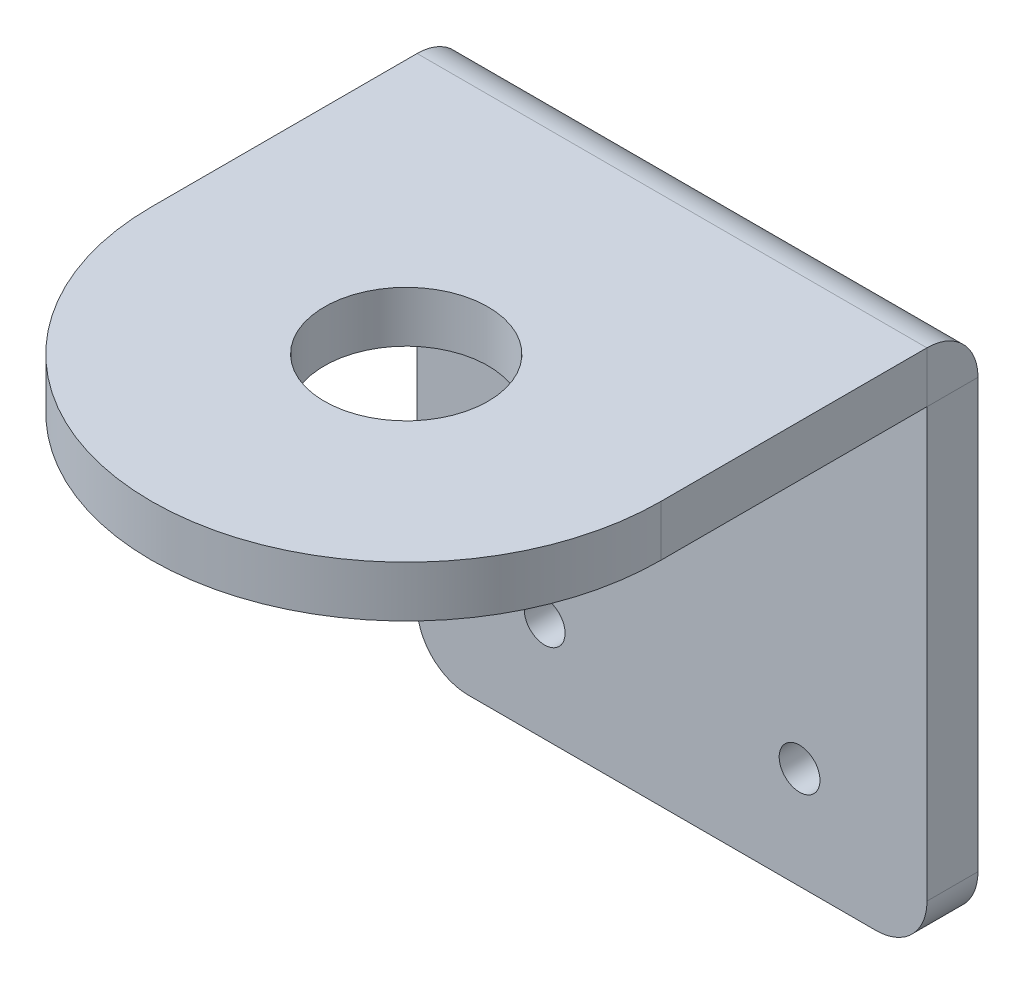
ISO-10303-21;
HEADER;
FILE_DESCRIPTION(('STEP AP214'),'2;1');
FILE_NAME('part.step','',(''),(''),'','','');
FILE_SCHEMA(('AUTOMOTIVE_DESIGN { 1 0 10303 214 1 1 1 1 }'));
ENDSEC;
DATA;
#1=APPLICATION_CONTEXT('core data for automotive mechanical design processes');
#2=APPLICATION_PROTOCOL_DEFINITION('international standard','automotive_design',2000,#1);
#3=PRODUCT_CONTEXT('',#1,'mechanical');
#4=PRODUCT('Part','Part','',(#3));
#5=PRODUCT_RELATED_PRODUCT_CATEGORY('part','',(#4));
#6=PRODUCT_DEFINITION_FORMATION('','',#4);
#7=PRODUCT_DEFINITION_CONTEXT('part definition',#1,'design');
#8=PRODUCT_DEFINITION('design','',#6,#7);
#9=PRODUCT_DEFINITION_SHAPE('','',#8);
#10=(LENGTH_UNIT() NAMED_UNIT(*) SI_UNIT(.MILLI.,.METRE.));
#11=(NAMED_UNIT(*) PLANE_ANGLE_UNIT() SI_UNIT($,.RADIAN.));
#12=(NAMED_UNIT(*) SI_UNIT($,.STERADIAN.) SOLID_ANGLE_UNIT());
#13=UNCERTAINTY_MEASURE_WITH_UNIT(LENGTH_MEASURE(1.E-05),#10,'distance_accuracy_value','');
#14=(GEOMETRIC_REPRESENTATION_CONTEXT(3) GLOBAL_UNCERTAINTY_ASSIGNED_CONTEXT((#13)) GLOBAL_UNIT_ASSIGNED_CONTEXT((#10,
#11,#12)) REPRESENTATION_CONTEXT('',''));
#15=CARTESIAN_POINT('',(0.,0.,0.));
#16=DIRECTION('',(0.,0.,1.));
#17=DIRECTION('',(1.,0.,0.));
#18=AXIS2_PLACEMENT_3D('',#15,#16,#17);
#19=CARTESIAN_POINT('',(20.,-29.9999999999998,-45.9226987802552));
#20=DIRECTION('',(0.,1.,0.));
#21=DIRECTION('',(-1.,0.,0.));
#22=AXIS2_PLACEMENT_3D('',#19,#20,#21);
#23=PLANE('',#22);
#24=CARTESIAN_POINT('',(0.,-30.0000000000001,26.0773012197448));
#25=DIRECTION('',(0.,-1.,0.));
#26=DIRECTION('',(1.,0.,0.));
#27=AXIS2_PLACEMENT_3D('',#24,#25,#26);
#28=CIRCLE('',#27,8.025);
#29=CARTESIAN_POINT('',(8.025,-30.0000000000001,26.0773012197448));
#30=VERTEX_POINT('',#29);
#31=EDGE_CURVE('E209',#30,#30,#28,.T.);
#32=ORIENTED_EDGE('',*,*,#31,.F.);
#33=EDGE_LOOP('',(#32));
#34=FACE_BOUND('',#33,.T.);
#35=DIRECTION('',(0.,0.,-1.));
#36=VECTOR('',#35,1.);
#37=CARTESIAN_POINT('',(-25.,-29.9999999999998,-45.9226987802552));
#38=LINE('',#37,#36);
#39=CARTESIAN_POINT('',(-25.,-30.0000000000001,26.0773012197448));
#40=VERTEX_POINT('',#39);
#41=CARTESIAN_POINT('',(-25.,-30.,0.00999999999998571));
#42=VERTEX_POINT('',#41);
#43=EDGE_CURVE('E59',#40,#42,#38,.T.);
#44=ORIENTED_EDGE('',*,*,#43,.T.);
#45=DIRECTION('',(1.,0.,0.));
#46=VECTOR('',#45,1.);
#47=CARTESIAN_POINT('',(20.,-30.,0.0099999999999649));
#48=LINE('',#47,#46);
#49=CARTESIAN_POINT('',(25.,-30.,0.00999999999998571));
#50=VERTEX_POINT('',#49);
#51=EDGE_CURVE('E51',#42,#50,#48,.T.);
#52=ORIENTED_EDGE('',*,*,#51,.T.);
#53=DIRECTION('',(0.,0.,1.));
#54=VECTOR('',#53,1.);
#55=CARTESIAN_POINT('',(25.,-29.9999999999998,-45.9226987802552));
#56=LINE('',#55,#54);
#57=CARTESIAN_POINT('',(25.,-30.0000000000001,26.0773012197448));
#58=VERTEX_POINT('',#57);
#59=EDGE_CURVE('E67',#50,#58,#56,.T.);
#60=ORIENTED_EDGE('',*,*,#59,.T.);
#61=CARTESIAN_POINT('',(0.,-30.0000000000001,26.0773012197448));
#62=DIRECTION('',(0.,-1.,0.));
#63=DIRECTION('',(1.,0.,0.));
#64=AXIS2_PLACEMENT_3D('',#61,#62,#63);
#65=CIRCLE('',#64,25.);
#66=EDGE_CURVE('E216',#58,#40,#65,.T.);
#67=ORIENTED_EDGE('',*,*,#66,.T.);
#68=EDGE_LOOP('',(#44,#52,#60,#67));
#69=FACE_BOUND('',#68,.T.);
#70=ADVANCED_FACE('F42',(#34,#69),#23,.F.);
#71=CARTESIAN_POINT('',(-25.,-24.9999999999998,-45.9226987802552));
#72=DIRECTION('',(-1.,0.,0.));
#73=DIRECTION('',(0.,0.,-1.));
#74=AXIS2_PLACEMENT_3D('',#71,#72,#73);
#75=PLANE('',#74);
#76=DIRECTION('',(0.,1.,0.));
#77=VECTOR('',#76,1.);
#78=CARTESIAN_POINT('',(-25.,-25.0000000000003,0.0100000000000169));
#79=LINE('',#78,#77);
#80=CARTESIAN_POINT('',(-25.,-25.,0.0100000000000169));
#81=VERTEX_POINT('',#80);
#82=EDGE_CURVE('E12',#42,#81,#79,.T.);
#83=ORIENTED_EDGE('',*,*,#82,.F.);
#84=ORIENTED_EDGE('',*,*,#43,.F.);
#85=DIRECTION('',(0.,-1.,0.));
#86=VECTOR('',#85,1.);
#87=CARTESIAN_POINT('',(-25.,-25.0000000000001,26.0773012197448));
#88=LINE('',#87,#86);
#89=CARTESIAN_POINT('',(-25.,-25.0000000000001,26.0773012197448));
#90=VERTEX_POINT('',#89);
#91=EDGE_CURVE('E218',#90,#40,#88,.T.);
#92=ORIENTED_EDGE('',*,*,#91,.F.);
#93=DIRECTION('',(0.,0.,-1.));
#94=VECTOR('',#93,1.);
#95=CARTESIAN_POINT('',(-25.,-24.9999999999998,-45.9226987802552));
#96=LINE('',#95,#94);
#97=EDGE_CURVE('E215',#90,#81,#96,.T.);
#98=ORIENTED_EDGE('',*,*,#97,.T.);
#99=EDGE_LOOP('',(#83,#84,#92,#98));
#100=FACE_BOUND('',#99,.T.);
#101=ADVANCED_FACE('F44',(#100),#75,.T.);
#102=CARTESIAN_POINT('',(0.,-25.0000000000001,26.0773012197448));
#103=DIRECTION('',(0.,-1.,0.));
#104=DIRECTION('',(1.,0.,0.));
#105=AXIS2_PLACEMENT_3D('',#102,#103,#104);
#106=CYLINDRICAL_SURFACE('',#105,25.);
#107=ORIENTED_EDGE('',*,*,#66,.F.);
#108=DIRECTION('',(0.,-1.,0.));
#109=VECTOR('',#108,1.);
#110=CARTESIAN_POINT('',(25.,-25.0000000000001,26.0773012197448));
#111=LINE('',#110,#109);
#112=CARTESIAN_POINT('',(25.,-25.0000000000001,26.0773012197448));
#113=VERTEX_POINT('',#112);
#114=EDGE_CURVE('E221',#113,#58,#111,.T.);
#115=ORIENTED_EDGE('',*,*,#114,.F.);
#116=CARTESIAN_POINT('',(0.,-25.0000000000001,26.0773012197448));
#117=DIRECTION('',(0.,-1.,0.));
#118=DIRECTION('',(1.,0.,0.));
#119=AXIS2_PLACEMENT_3D('',#116,#117,#118);
#120=CIRCLE('',#119,25.);
#121=EDGE_CURVE('E212',#113,#90,#120,.T.);
#122=ORIENTED_EDGE('',*,*,#121,.T.);
#123=ORIENTED_EDGE('',*,*,#91,.T.);
#124=EDGE_LOOP('',(#107,#115,#122,#123));
#125=FACE_BOUND('',#124,.T.);
#126=ADVANCED_FACE('F237',(#125),#106,.T.);
#127=CARTESIAN_POINT('',(25.,-24.9999999999998,-45.9226987802552));
#128=DIRECTION('',(1.,0.,0.));
#129=DIRECTION('',(0.,0.,1.));
#130=AXIS2_PLACEMENT_3D('',#127,#128,#129);
#131=PLANE('',#130);
#132=DIRECTION('',(0.,-1.,0.));
#133=VECTOR('',#132,1.);
#134=CARTESIAN_POINT('',(25.,-25.0000000000003,0.0100000000000169));
#135=LINE('',#134,#133);
#136=CARTESIAN_POINT('',(25.,-25.,0.0100000000000083));
#137=VERTEX_POINT('',#136);
#138=EDGE_CURVE('E224',#137,#50,#135,.T.);
#139=ORIENTED_EDGE('',*,*,#138,.F.);
#140=DIRECTION('',(0.,0.,1.));
#141=VECTOR('',#140,1.);
#142=CARTESIAN_POINT('',(25.,-24.9999999999998,-45.9226987802552));
#143=LINE('',#142,#141);
#144=EDGE_CURVE('E46',#137,#113,#143,.T.);
#145=ORIENTED_EDGE('',*,*,#144,.T.);
#146=ORIENTED_EDGE('',*,*,#114,.T.);
#147=ORIENTED_EDGE('',*,*,#59,.F.);
#148=EDGE_LOOP('',(#139,#145,#146,#147));
#149=FACE_BOUND('',#148,.T.);
#150=ADVANCED_FACE('F232',(#149),#131,.T.);
#151=CARTESIAN_POINT('',(20.,-24.9999999999998,-45.9226987802552));
#152=DIRECTION('',(0.,1.,0.));
#153=DIRECTION('',(-1.,0.,0.));
#154=AXIS2_PLACEMENT_3D('',#151,#152,#153);
#155=PLANE('',#154);
#156=DIRECTION('',(1.,0.,0.));
#157=VECTOR('',#156,1.);
#158=CARTESIAN_POINT('',(20.,-25.,0.0100000000000169));
#159=LINE('',#158,#157);
#160=EDGE_CURVE('E220',#81,#137,#159,.T.);
#161=ORIENTED_EDGE('',*,*,#160,.F.);
#162=ORIENTED_EDGE('',*,*,#97,.F.);
#163=ORIENTED_EDGE('',*,*,#121,.F.);
#164=ORIENTED_EDGE('',*,*,#144,.F.);
#165=EDGE_LOOP('',(#161,#162,#163,#164));
#166=FACE_BOUND('',#165,.T.);
#167=CARTESIAN_POINT('',(0.,-25.0000000000001,26.0773012197448));
#168=DIRECTION('',(0.,-1.,0.));
#169=DIRECTION('',(1.,0.,0.));
#170=AXIS2_PLACEMENT_3D('',#167,#168,#169);
#171=CIRCLE('',#170,8.025);
#172=CARTESIAN_POINT('',(8.025,-25.0000000000001,26.0773012197448));
#173=VERTEX_POINT('',#172);
#174=EDGE_CURVE('E206',#173,#173,#171,.T.);
#175=ORIENTED_EDGE('',*,*,#174,.T.);
#176=EDGE_LOOP('',(#175));
#177=FACE_BOUND('',#176,.T.);
#178=ADVANCED_FACE('F239',(#166,#177),#155,.T.);
#179=CARTESIAN_POINT('',(0.,-25.0000000000001,26.0773012197448));
#180=DIRECTION('',(0.,-1.,0.));
#181=DIRECTION('',(1.,0.,0.));
#182=AXIS2_PLACEMENT_3D('',#179,#180,#181);
#183=CYLINDRICAL_SURFACE('',#182,8.025);
#184=ORIENTED_EDGE('',*,*,#174,.F.);
#185=EDGE_LOOP('',(#184));
#186=FACE_BOUND('',#185,.T.);
#187=ORIENTED_EDGE('',*,*,#31,.T.);
#188=EDGE_LOOP('',(#187));
#189=FACE_BOUND('',#188,.T.);
#190=ADVANCED_FACE('F290',(#186,#189),#183,.F.);
#191=CARTESIAN_POINT('',(-20.,-72.,-5.));
#192=DIRECTION('',(0.,0.,1.));
#193=DIRECTION('',(1.,0.,0.));
#194=AXIS2_PLACEMENT_3D('',#191,#192,#193);
#195=CYLINDRICAL_SURFACE('',#194,5.);
#196=CARTESIAN_POINT('',(-20.,-72.,0.));
#197=DIRECTION('',(0.,0.,1.));
#198=DIRECTION('',(1.,0.,0.));
#199=AXIS2_PLACEMENT_3D('',#196,#197,#198);
#200=CIRCLE('',#199,5.);
#201=CARTESIAN_POINT('',(-25.,-72.,0.));
#202=VERTEX_POINT('',#201);
#203=CARTESIAN_POINT('',(-20.,-77.,0.));
#204=VERTEX_POINT('',#203);
#205=EDGE_CURVE('E172',#202,#204,#200,.T.);
#206=ORIENTED_EDGE('',*,*,#205,.F.);
#207=DIRECTION('',(0.,0.,1.));
#208=VECTOR('',#207,1.);
#209=CARTESIAN_POINT('',(-25.,-72.,-5.));
#210=LINE('',#209,#208);
#211=CARTESIAN_POINT('',(-25.,-72.,-5.));
#212=VERTEX_POINT('',#211);
#213=EDGE_CURVE('E154',#212,#202,#210,.T.);
#214=ORIENTED_EDGE('',*,*,#213,.F.);
#215=CARTESIAN_POINT('',(-20.,-72.,-5.));
#216=DIRECTION('',(0.,0.,1.));
#217=DIRECTION('',(1.,0.,0.));
#218=AXIS2_PLACEMENT_3D('',#215,#216,#217);
#219=CIRCLE('',#218,5.);
#220=CARTESIAN_POINT('',(-20.,-77.,-5.));
#221=VERTEX_POINT('',#220);
#222=EDGE_CURVE('E150',#212,#221,#219,.T.);
#223=ORIENTED_EDGE('',*,*,#222,.T.);
#224=DIRECTION('',(0.,0.,1.));
#225=VECTOR('',#224,1.);
#226=CARTESIAN_POINT('',(-20.,-77.,-5.));
#227=LINE('',#226,#225);
#228=EDGE_CURVE('E201',#221,#204,#227,.T.);
#229=ORIENTED_EDGE('',*,*,#228,.T.);
#230=EDGE_LOOP('',(#206,#214,#223,#229));
#231=FACE_BOUND('',#230,.T.);
#232=ADVANCED_FACE('F255',(#231),#195,.T.);
#233=CARTESIAN_POINT('',(-20.,-77.,-5.));
#234=DIRECTION('',(0.,-1.,0.));
#235=DIRECTION('',(0.,0.,-1.));
#236=AXIS2_PLACEMENT_3D('',#233,#234,#235);
#237=PLANE('',#236);
#238=DIRECTION('',(1.,0.,0.));
#239=VECTOR('',#238,1.);
#240=CARTESIAN_POINT('',(-20.,-77.,0.));
#241=LINE('',#240,#239);
#242=CARTESIAN_POINT('',(20.,-77.,0.));
#243=VERTEX_POINT('',#242);
#244=EDGE_CURVE('E169',#204,#243,#241,.T.);
#245=ORIENTED_EDGE('',*,*,#244,.F.);
#246=ORIENTED_EDGE('',*,*,#228,.F.);
#247=DIRECTION('',(1.,0.,0.));
#248=VECTOR('',#247,1.);
#249=CARTESIAN_POINT('',(-20.,-77.,-5.));
#250=LINE('',#249,#248);
#251=CARTESIAN_POINT('',(20.,-77.,-5.));
#252=VERTEX_POINT('',#251);
#253=EDGE_CURVE('E198',#221,#252,#250,.T.);
#254=ORIENTED_EDGE('',*,*,#253,.T.);
#255=DIRECTION('',(0.,0.,1.));
#256=VECTOR('',#255,1.);
#257=CARTESIAN_POINT('',(20.,-77.,-5.));
#258=LINE('',#257,#256);
#259=EDGE_CURVE('E196',#252,#243,#258,.T.);
#260=ORIENTED_EDGE('',*,*,#259,.T.);
#261=EDGE_LOOP('',(#245,#246,#254,#260));
#262=FACE_BOUND('',#261,.T.);
#263=ADVANCED_FACE('F261',(#262),#237,.T.);
#264=CARTESIAN_POINT('',(20.,-72.,-5.));
#265=DIRECTION('',(0.,0.,1.));
#266=DIRECTION('',(1.,0.,0.));
#267=AXIS2_PLACEMENT_3D('',#264,#265,#266);
#268=CYLINDRICAL_SURFACE('',#267,5.);
#269=CARTESIAN_POINT('',(20.,-72.,0.));
#270=DIRECTION('',(0.,0.,1.));
#271=DIRECTION('',(-1.,0.,0.));
#272=AXIS2_PLACEMENT_3D('',#269,#270,#271);
#273=CIRCLE('',#272,5.);
#274=CARTESIAN_POINT('',(25.,-72.,0.));
#275=VERTEX_POINT('',#274);
#276=EDGE_CURVE('E163',#243,#275,#273,.T.);
#277=ORIENTED_EDGE('',*,*,#276,.F.);
#278=ORIENTED_EDGE('',*,*,#259,.F.);
#279=CARTESIAN_POINT('',(20.,-72.,-5.));
#280=DIRECTION('',(0.,0.,1.));
#281=DIRECTION('',(-1.,0.,0.));
#282=AXIS2_PLACEMENT_3D('',#279,#280,#281);
#283=CIRCLE('',#282,5.);
#284=CARTESIAN_POINT('',(25.,-72.,-5.));
#285=VERTEX_POINT('',#284);
#286=EDGE_CURVE('E193',#252,#285,#283,.T.);
#287=ORIENTED_EDGE('',*,*,#286,.T.);
#288=DIRECTION('',(0.,0.,1.));
#289=VECTOR('',#288,1.);
#290=CARTESIAN_POINT('',(25.,-72.,-5.));
#291=LINE('',#290,#289);
#292=EDGE_CURVE('E191',#285,#275,#291,.T.);
#293=ORIENTED_EDGE('',*,*,#292,.T.);
#294=EDGE_LOOP('',(#277,#278,#287,#293));
#295=FACE_BOUND('',#294,.T.);
#296=ADVANCED_FACE('F265',(#295),#268,.T.);
#297=CARTESIAN_POINT('',(12.5,-67.,-5.));
#298=DIRECTION('',(0.,0.,1.));
#299=DIRECTION('',(1.,0.,0.));
#300=AXIS2_PLACEMENT_3D('',#297,#298,#299);
#301=CYLINDRICAL_SURFACE('',#300,2.);
#302=CARTESIAN_POINT('',(12.5,-67.,-5.));
#303=DIRECTION('',(0.,0.,1.));
#304=DIRECTION('',(1.,0.,0.));
#305=AXIS2_PLACEMENT_3D('',#302,#303,#304);
#306=CIRCLE('',#305,2.);
#307=CARTESIAN_POINT('',(14.5,-67.,-5.));
#308=VERTEX_POINT('',#307);
#309=EDGE_CURVE('E143',#308,#308,#306,.T.);
#310=ORIENTED_EDGE('',*,*,#309,.F.);
#311=EDGE_LOOP('',(#310));
#312=FACE_BOUND('',#311,.T.);
#313=CARTESIAN_POINT('',(12.5,-67.,0.));
#314=DIRECTION('',(0.,0.,1.));
#315=DIRECTION('',(1.,0.,0.));
#316=AXIS2_PLACEMENT_3D('',#313,#314,#315);
#317=CIRCLE('',#316,2.);
#318=CARTESIAN_POINT('',(14.5,-67.,0.));
#319=VERTEX_POINT('',#318);
#320=EDGE_CURVE('E188',#319,#319,#317,.T.);
#321=ORIENTED_EDGE('',*,*,#320,.T.);
#322=EDGE_LOOP('',(#321));
#323=FACE_BOUND('',#322,.T.);
#324=ADVANCED_FACE('F313',(#312,#323),#301,.F.);
#325=CARTESIAN_POINT('',(-12.5,-67.,-5.));
#326=DIRECTION('',(0.,0.,1.));
#327=DIRECTION('',(1.,0.,0.));
#328=AXIS2_PLACEMENT_3D('',#325,#326,#327);
#329=CYLINDRICAL_SURFACE('',#328,2.);
#330=CARTESIAN_POINT('',(-12.5,-67.,-5.));
#331=DIRECTION('',(0.,0.,1.));
#332=DIRECTION('',(1.,0.,0.));
#333=AXIS2_PLACEMENT_3D('',#330,#331,#332);
#334=CIRCLE('',#333,2.);
#335=CARTESIAN_POINT('',(-10.5,-67.,-5.));
#336=VERTEX_POINT('',#335);
#337=EDGE_CURVE('E182',#336,#336,#334,.T.);
#338=ORIENTED_EDGE('',*,*,#337,.F.);
#339=EDGE_LOOP('',(#338));
#340=FACE_BOUND('',#339,.T.);
#341=CARTESIAN_POINT('',(-12.5,-67.,0.));
#342=DIRECTION('',(0.,0.,1.));
#343=DIRECTION('',(1.,0.,0.));
#344=AXIS2_PLACEMENT_3D('',#341,#342,#343);
#345=CIRCLE('',#344,2.);
#346=CARTESIAN_POINT('',(-10.5,-67.,0.));
#347=VERTEX_POINT('',#346);
#348=EDGE_CURVE('E185',#347,#347,#345,.T.);
#349=ORIENTED_EDGE('',*,*,#348,.T.);
#350=EDGE_LOOP('',(#349));
#351=FACE_BOUND('',#350,.T.);
#352=ADVANCED_FACE('F276',(#340,#351),#329,.F.);
#353=CARTESIAN_POINT('',(20.,-72.,-5.));
#354=DIRECTION('',(0.,0.,-1.));
#355=DIRECTION('',(-1.,0.,0.));
#356=AXIS2_PLACEMENT_3D('',#353,#354,#355);
#357=PLANE('',#356);
#358=ORIENTED_EDGE('',*,*,#337,.T.);
#359=EDGE_LOOP('',(#358));
#360=FACE_BOUND('',#359,.T.);
#361=ORIENTED_EDGE('',*,*,#309,.T.);
#362=EDGE_LOOP('',(#361));
#363=FACE_BOUND('',#362,.T.);
#364=DIRECTION('',(0.,-1.,0.));
#365=VECTOR('',#364,1.);
#366=CARTESIAN_POINT('',(-25.,-72.,-5.));
#367=LINE('',#366,#365);
#368=CARTESIAN_POINT('',(-25.,-30.01,-5.));
#369=VERTEX_POINT('',#368);
#370=EDGE_CURVE('E146',#369,#212,#367,.T.);
#371=ORIENTED_EDGE('',*,*,#370,.F.);
#372=DIRECTION('',(1.,0.,0.));
#373=VECTOR('',#372,1.);
#374=CARTESIAN_POINT('',(20.,-30.01,-5.));
#375=LINE('',#374,#373);
#376=CARTESIAN_POINT('',(25.,-30.01,-5.));
#377=VERTEX_POINT('',#376);
#378=EDGE_CURVE('E135',#369,#377,#375,.T.);
#379=ORIENTED_EDGE('',*,*,#378,.T.);
#380=DIRECTION('',(0.,1.,0.));
#381=VECTOR('',#380,1.);
#382=CARTESIAN_POINT('',(25.,-72.,-5.));
#383=LINE('',#382,#381);
#384=EDGE_CURVE('E142',#285,#377,#383,.T.);
#385=ORIENTED_EDGE('',*,*,#384,.F.);
#386=ORIENTED_EDGE('',*,*,#286,.F.);
#387=ORIENTED_EDGE('',*,*,#253,.F.);
#388=ORIENTED_EDGE('',*,*,#222,.F.);
#389=EDGE_LOOP('',(#371,#379,#385,#386,#387,#388));
#390=FACE_BOUND('',#389,.T.);
#391=ADVANCED_FACE('F147',(#360,#363,#390),#357,.T.);
#392=CARTESIAN_POINT('',(25.,-72.,-5.));
#393=DIRECTION('',(1.,0.,0.));
#394=DIRECTION('',(0.,1.,0.));
#395=AXIS2_PLACEMENT_3D('',#392,#393,#394);
#396=PLANE('',#395);
#397=ORIENTED_EDGE('',*,*,#384,.T.);
#398=DIRECTION('',(0.,0.,1.));
#399=VECTOR('',#398,1.);
#400=CARTESIAN_POINT('',(25.,-30.01,-4.99999999999971));
#401=LINE('',#400,#399);
#402=CARTESIAN_POINT('',(25.,-30.01,0.));
#403=VERTEX_POINT('',#402);
#404=EDGE_CURVE('E176',#377,#403,#401,.T.);
#405=ORIENTED_EDGE('',*,*,#404,.T.);
#406=DIRECTION('',(0.,1.,0.));
#407=VECTOR('',#406,1.);
#408=CARTESIAN_POINT('',(25.,-72.,0.));
#409=LINE('',#408,#407);
#410=EDGE_CURVE('E160',#275,#403,#409,.T.);
#411=ORIENTED_EDGE('',*,*,#410,.F.);
#412=ORIENTED_EDGE('',*,*,#292,.F.);
#413=EDGE_LOOP('',(#397,#405,#411,#412));
#414=FACE_BOUND('',#413,.T.);
#415=ADVANCED_FACE('F268',(#414),#396,.T.);
#416=CARTESIAN_POINT('',(20.,-72.,0.));
#417=DIRECTION('',(0.,0.,-1.));
#418=DIRECTION('',(-1.,0.,0.));
#419=AXIS2_PLACEMENT_3D('',#416,#417,#418);
#420=PLANE('',#419);
#421=DIRECTION('',(1.,0.,0.));
#422=VECTOR('',#421,1.);
#423=CARTESIAN_POINT('',(20.,-30.01,0.));
#424=LINE('',#423,#422);
#425=CARTESIAN_POINT('',(-25.,-30.01,0.));
#426=VERTEX_POINT('',#425);
#427=EDGE_CURVE('E204',#426,#403,#424,.T.);
#428=ORIENTED_EDGE('',*,*,#427,.F.);
#429=DIRECTION('',(0.,-1.,0.));
#430=VECTOR('',#429,1.);
#431=CARTESIAN_POINT('',(-25.,-72.,0.));
#432=LINE('',#431,#430);
#433=EDGE_CURVE('E158',#426,#202,#432,.T.);
#434=ORIENTED_EDGE('',*,*,#433,.T.);
#435=ORIENTED_EDGE('',*,*,#205,.T.);
#436=ORIENTED_EDGE('',*,*,#244,.T.);
#437=ORIENTED_EDGE('',*,*,#276,.T.);
#438=ORIENTED_EDGE('',*,*,#410,.T.);
#439=EDGE_LOOP('',(#428,#434,#435,#436,#437,#438));
#440=FACE_BOUND('',#439,.T.);
#441=ORIENTED_EDGE('',*,*,#320,.F.);
#442=EDGE_LOOP('',(#441));
#443=FACE_BOUND('',#442,.T.);
#444=ORIENTED_EDGE('',*,*,#348,.F.);
#445=EDGE_LOOP('',(#444));
#446=FACE_BOUND('',#445,.T.);
#447=ADVANCED_FACE('F258',(#440,#443,#446),#420,.F.);
#448=CARTESIAN_POINT('',(-25.,-72.,-5.));
#449=DIRECTION('',(-1.,0.,0.));
#450=DIRECTION('',(0.,-1.,0.));
#451=AXIS2_PLACEMENT_3D('',#448,#449,#450);
#452=PLANE('',#451);
#453=ORIENTED_EDGE('',*,*,#433,.F.);
#454=DIRECTION('',(0.,0.,-1.));
#455=VECTOR('',#454,1.);
#456=CARTESIAN_POINT('',(-25.,-30.01,-4.99999999999971));
#457=LINE('',#456,#455);
#458=EDGE_CURVE('E126',#426,#369,#457,.T.);
#459=ORIENTED_EDGE('',*,*,#458,.T.);
#460=ORIENTED_EDGE('',*,*,#370,.T.);
#461=ORIENTED_EDGE('',*,*,#213,.T.);
#462=EDGE_LOOP('',(#453,#459,#460,#461));
#463=FACE_BOUND('',#462,.T.);
#464=ADVANCED_FACE('F157',(#463),#452,.T.);
#465=CARTESIAN_POINT('',(-25.,-30.01,0.00999999999999959));
#466=DIRECTION('',(-1.,0.,0.));
#467=DIRECTION('',(0.,0.,1.));
#468=AXIS2_PLACEMENT_3D('',#465,#466,#467);
#469=PLANE('',#468);
#470=ORIENTED_EDGE('',*,*,#458,.F.);
#471=CARTESIAN_POINT('',(-25.,-30.01,0.00999999999999959));
#472=DIRECTION('',(1.,0.,0.));
#473=DIRECTION('',(0.,0.,-1.));
#474=AXIS2_PLACEMENT_3D('',#471,#472,#473);
#475=CIRCLE('',#474,0.00999999999999959);
#476=EDGE_CURVE('E249',#426,#42,#475,.T.);
#477=ORIENTED_EDGE('',*,*,#476,.T.);
#478=ORIENTED_EDGE('',*,*,#82,.T.);
#479=CARTESIAN_POINT('',(-25.,-30.01,0.00999999999999959));
#480=DIRECTION('',(1.,0.,0.));
#481=DIRECTION('',(0.,0.,1.));
#482=AXIS2_PLACEMENT_3D('',#479,#480,#481);
#483=CIRCLE('',#482,5.01);
#484=EDGE_CURVE('E121',#369,#81,#483,.T.);
#485=ORIENTED_EDGE('',*,*,#484,.F.);
#486=EDGE_LOOP('',(#470,#477,#478,#485));
#487=FACE_BOUND('',#486,.T.);
#488=ADVANCED_FACE('F123',(#487),#469,.T.);
#489=CARTESIAN_POINT('',(25.,-30.01,0.00999999999999959));
#490=DIRECTION('',(1.,0.,0.));
#491=DIRECTION('',(0.,0.,-1.));
#492=AXIS2_PLACEMENT_3D('',#489,#490,#491);
#493=PLANE('',#492);
#494=ORIENTED_EDGE('',*,*,#138,.T.);
#495=CARTESIAN_POINT('',(25.,-30.01,0.00999999999999959));
#496=DIRECTION('',(1.,0.,0.));
#497=DIRECTION('',(0.,0.,-1.));
#498=AXIS2_PLACEMENT_3D('',#495,#496,#497);
#499=CIRCLE('',#498,0.00999999999999959);
#500=EDGE_CURVE('E131',#50,#403,#499,.F.);
#501=ORIENTED_EDGE('',*,*,#500,.T.);
#502=ORIENTED_EDGE('',*,*,#404,.F.);
#503=CARTESIAN_POINT('',(25.,-30.01,0.00999999999999959));
#504=DIRECTION('',(-1.,0.,0.));
#505=DIRECTION('',(0.,0.,-1.));
#506=AXIS2_PLACEMENT_3D('',#503,#504,#505);
#507=CIRCLE('',#506,5.01);
#508=EDGE_CURVE('E130',#137,#377,#507,.T.);
#509=ORIENTED_EDGE('',*,*,#508,.F.);
#510=EDGE_LOOP('',(#494,#501,#502,#509));
#511=FACE_BOUND('',#510,.T.);
#512=ADVANCED_FACE('F247',(#511),#493,.T.);
#513=CARTESIAN_POINT('',(-50.4038180465709,-30.01,0.00999999999999959));
#514=DIRECTION('',(1.,0.,0.));
#515=DIRECTION('',(0.,0.,-1.));
#516=AXIS2_PLACEMENT_3D('',#513,#514,#515);
#517=CYLINDRICAL_SURFACE('',#516,5.01);
#518=ORIENTED_EDGE('',*,*,#508,.T.);
#519=ORIENTED_EDGE('',*,*,#378,.F.);
#520=ORIENTED_EDGE('',*,*,#484,.T.);
#521=ORIENTED_EDGE('',*,*,#160,.T.);
#522=EDGE_LOOP('',(#518,#519,#520,#521));
#523=FACE_BOUND('',#522,.T.);
#524=ADVANCED_FACE('F137',(#523),#517,.T.);
#525=CARTESIAN_POINT('',(-50.4038180465709,-30.01,0.00999999999999959));
#526=DIRECTION('',(1.,0.,0.));
#527=DIRECTION('',(0.,0.,-1.));
#528=AXIS2_PLACEMENT_3D('',#525,#526,#527);
#529=CYLINDRICAL_SURFACE('',#528,0.00999999999999959);
#530=ORIENTED_EDGE('',*,*,#500,.F.);
#531=ORIENTED_EDGE('',*,*,#51,.F.);
#532=ORIENTED_EDGE('',*,*,#476,.F.);
#533=ORIENTED_EDGE('',*,*,#427,.T.);
#534=EDGE_LOOP('',(#530,#531,#532,#533));
#535=FACE_BOUND('',#534,.T.);
#536=ADVANCED_FACE('F248',(#535),#529,.F.);
#537=CLOSED_SHELL('',(#70,#101,#126,#150,#178,#190,#232,#263,#296,#324,#352,#391,#415,#447,#464,
#488,#512,#524,#536));
#538=MANIFOLD_SOLID_BREP('B2',#537);
#539=ADVANCED_BREP_SHAPE_REPRESENTATION('',(#18,#538),#14);
#540=SHAPE_DEFINITION_REPRESENTATION(#9,#539);
ENDSEC;
END-ISO-10303-21;
